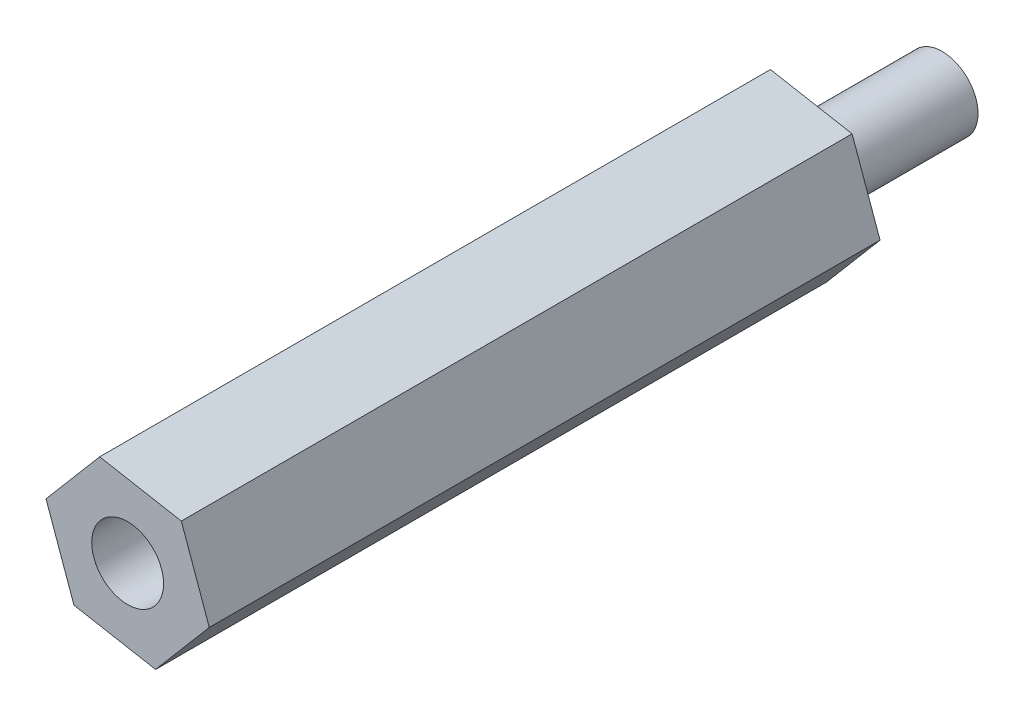
ISO-10303-21;
HEADER;
FILE_DESCRIPTION(('STEP AP214'),'2;1');
FILE_NAME('part.step','',(''),(''),'','','');
FILE_SCHEMA(('AUTOMOTIVE_DESIGN { 1 0 10303 214 1 1 1 1 }'));
ENDSEC;
DATA;
#1=APPLICATION_CONTEXT('core data for automotive mechanical design processes');
#2=APPLICATION_PROTOCOL_DEFINITION('international standard','automotive_design',2000,#1);
#3=PRODUCT_CONTEXT('',#1,'mechanical');
#4=PRODUCT('Part','Part','',(#3));
#5=PRODUCT_RELATED_PRODUCT_CATEGORY('part','',(#4));
#6=PRODUCT_DEFINITION_FORMATION('','',#4);
#7=PRODUCT_DEFINITION_CONTEXT('part definition',#1,'design');
#8=PRODUCT_DEFINITION('design','',#6,#7);
#9=PRODUCT_DEFINITION_SHAPE('','',#8);
#10=(LENGTH_UNIT() NAMED_UNIT(*) SI_UNIT(.MILLI.,.METRE.));
#11=(NAMED_UNIT(*) PLANE_ANGLE_UNIT() SI_UNIT($,.RADIAN.));
#12=(NAMED_UNIT(*) SI_UNIT($,.STERADIAN.) SOLID_ANGLE_UNIT());
#13=UNCERTAINTY_MEASURE_WITH_UNIT(LENGTH_MEASURE(1.E-05),#10,'distance_accuracy_value','');
#14=(GEOMETRIC_REPRESENTATION_CONTEXT(3) GLOBAL_UNCERTAINTY_ASSIGNED_CONTEXT((#13)) GLOBAL_UNIT_ASSIGNED_CONTEXT((#10,
#11,#12)) REPRESENTATION_CONTEXT('',''));
#15=CARTESIAN_POINT('',(0.,0.,0.));
#16=DIRECTION('',(0.,0.,1.));
#17=DIRECTION('',(1.,0.,0.));
#18=AXIS2_PLACEMENT_3D('',#15,#16,#17);
#19=CARTESIAN_POINT('',(10.6919799005155,-6.78529493686556,-6.));
#20=DIRECTION('',(0.,0.,1.));
#21=DIRECTION('',(1.,0.,0.));
#22=AXIS2_PLACEMENT_3D('',#19,#20,#21);
#23=CYLINDRICAL_SURFACE('',#22,1.5);
#24=CARTESIAN_POINT('',(10.6919799005155,-6.78529493686556,-6.));
#25=DIRECTION('',(0.,0.,-1.));
#26=DIRECTION('',(-1.,0.,0.));
#27=AXIS2_PLACEMENT_3D('',#24,#25,#26);
#28=CIRCLE('',#27,1.5);
#29=CARTESIAN_POINT('',(9.19197990051546,-6.78529493686556,-6.));
#30=VERTEX_POINT('',#29);
#31=EDGE_CURVE('E11',#30,#30,#28,.T.);
#32=ORIENTED_EDGE('',*,*,#31,.F.);
#33=EDGE_LOOP('',(#32));
#34=FACE_BOUND('',#33,.T.);
#35=CARTESIAN_POINT('',(10.6919799005155,-6.78529493686556,0.));
#36=DIRECTION('',(0.,0.,-1.));
#37=DIRECTION('',(-1.,0.,0.));
#38=AXIS2_PLACEMENT_3D('',#35,#36,#37);
#39=CIRCLE('',#38,1.5);
#40=CARTESIAN_POINT('',(9.19197990051546,-6.78529493686556,0.));
#41=VERTEX_POINT('',#40);
#42=EDGE_CURVE('E46',#41,#41,#39,.T.);
#43=ORIENTED_EDGE('',*,*,#42,.T.);
#44=EDGE_LOOP('',(#43));
#45=FACE_BOUND('',#44,.T.);
#46=ADVANCED_FACE('F43',(#34,#45),#23,.T.);
#47=CARTESIAN_POINT('',(10.6919799005155,-6.78529493686556,-6.));
#48=DIRECTION('',(0.,0.,-1.));
#49=DIRECTION('',(-1.,0.,0.));
#50=AXIS2_PLACEMENT_3D('',#47,#48,#49);
#51=PLANE('',#50);
#52=ORIENTED_EDGE('',*,*,#31,.T.);
#53=EDGE_LOOP('',(#52));
#54=FACE_BOUND('',#53,.T.);
#55=ADVANCED_FACE('F58',(#54),#51,.T.);
#56=CARTESIAN_POINT('',(10.6919799005155,-6.78529493686556,0.));
#57=DIRECTION('',(0.,0.,-1.));
#58=DIRECTION('',(-1.,0.,0.));
#59=AXIS2_PLACEMENT_3D('',#56,#57,#58);
#60=PLANE('',#59);
#61=ORIENTED_EDGE('',*,*,#42,.F.);
#62=EDGE_LOOP('',(#61));
#63=FACE_BOUND('',#62,.T.);
#64=ADVANCED_FACE('F56',(#63),#60,.F.);
#65=CLOSED_SHELL('',(#46,#55,#64));
#66=MANIFOLD_SOLID_BREP('B2',#65);
#67=CARTESIAN_POINT('',(14.100105118259,-7.40552271774973,28.));
#68=DIRECTION('',(-0.941553473498977,-0.336863557753005,0.));
#69=DIRECTION('',(0.336863557753005,-0.941553473498977,0.));
#70=AXIS2_PLACEMENT_3D('',#67,#68,#69);
#71=PLANE('',#70);
#72=DIRECTION('',(-0.336863557753005,0.941553473498977,0.));
#73=VECTOR('',#72,1.);
#74=CARTESIAN_POINT('',(14.100105118259,-7.40552271774973,0.));
#75=LINE('',#74,#73);
#76=CARTESIAN_POINT('',(14.100105118259,-7.40552271774973,0.));
#77=VERTEX_POINT('',#76);
#78=CARTESIAN_POINT('',(12.9331755237658,-4.14388580946336,0.));
#79=VERTEX_POINT('',#78);
#80=EDGE_CURVE('E168',#77,#79,#75,.T.);
#81=ORIENTED_EDGE('',*,*,#80,.T.);
#82=DIRECTION('',(0.,0.,-1.));
#83=VECTOR('',#82,1.);
#84=CARTESIAN_POINT('',(12.9331755237658,-4.14388580946336,28.));
#85=LINE('',#84,#83);
#86=CARTESIAN_POINT('',(12.9331755237658,-4.14388580946336,28.));
#87=VERTEX_POINT('',#86);
#88=EDGE_CURVE('E41',#87,#79,#85,.T.);
#89=ORIENTED_EDGE('',*,*,#88,.F.);
#90=DIRECTION('',(-0.336863557753005,0.941553473498977,0.));
#91=VECTOR('',#90,1.);
#92=CARTESIAN_POINT('',(14.100105118259,-7.40552271774973,28.));
#93=LINE('',#92,#91);
#94=CARTESIAN_POINT('',(14.100105118259,-7.40552271774973,28.));
#95=VERTEX_POINT('',#94);
#96=EDGE_CURVE('E179',#95,#87,#93,.T.);
#97=ORIENTED_EDGE('',*,*,#96,.F.);
#98=DIRECTION('',(0.,0.,-1.));
#99=VECTOR('',#98,1.);
#100=CARTESIAN_POINT('',(14.100105118259,-7.40552271774973,28.));
#101=LINE('',#100,#99);
#102=EDGE_CURVE('E164',#95,#77,#101,.T.);
#103=ORIENTED_EDGE('',*,*,#102,.T.);
#104=EDGE_LOOP('',(#81,#89,#97,#103));
#105=FACE_BOUND('',#104,.T.);
#106=ADVANCED_FACE('F84',(#105),#71,.F.);
#107=CARTESIAN_POINT('',(12.9331755237658,-4.14388580946336,28.));
#108=DIRECTION('',(-0.17904433812618,-0.983841005948094,0.));
#109=DIRECTION('',(0.983841005948094,-0.17904433812618,0.));
#110=AXIS2_PLACEMENT_3D('',#107,#108,#109);
#111=PLANE('',#110);
#112=DIRECTION('',(-0.983841005948094,0.17904433812618,0.));
#113=VECTOR('',#112,1.);
#114=CARTESIAN_POINT('',(12.9331755237658,-4.14388580946336,0.));
#115=LINE('',#114,#113);
#116=CARTESIAN_POINT('',(9.52505030602222,-3.52365802857919,0.));
#117=VERTEX_POINT('',#116);
#118=EDGE_CURVE('E171',#79,#117,#115,.T.);
#119=ORIENTED_EDGE('',*,*,#118,.T.);
#120=DIRECTION('',(0.,0.,-1.));
#121=VECTOR('',#120,1.);
#122=CARTESIAN_POINT('',(9.52505030602222,-3.52365802857919,28.));
#123=LINE('',#122,#121);
#124=CARTESIAN_POINT('',(9.52505030602222,-3.52365802857919,28.));
#125=VERTEX_POINT('',#124);
#126=EDGE_CURVE('E92',#125,#117,#123,.T.);
#127=ORIENTED_EDGE('',*,*,#126,.F.);
#128=DIRECTION('',(-0.983841005948094,0.17904433812618,0.));
#129=VECTOR('',#128,1.);
#130=CARTESIAN_POINT('',(12.9331755237658,-4.14388580946336,28.));
#131=LINE('',#130,#129);
#132=EDGE_CURVE('E137',#87,#125,#131,.T.);
#133=ORIENTED_EDGE('',*,*,#132,.F.);
#134=ORIENTED_EDGE('',*,*,#88,.T.);
#135=EDGE_LOOP('',(#119,#127,#133,#134));
#136=FACE_BOUND('',#135,.T.);
#137=ADVANCED_FACE('F204',(#136),#111,.F.);
#138=CARTESIAN_POINT('',(9.52505030602222,-3.52365802857919,28.));
#139=DIRECTION('',(0.762509135372797,-0.64697744819509,0.));
#140=DIRECTION('',(0.64697744819509,0.762509135372797,0.));
#141=AXIS2_PLACEMENT_3D('',#138,#139,#140);
#142=PLANE('',#141);
#143=DIRECTION('',(-0.64697744819509,-0.762509135372797,0.));
#144=VECTOR('',#143,1.);
#145=CARTESIAN_POINT('',(9.52505030602222,-3.52365802857919,0.));
#146=LINE('',#145,#144);
#147=CARTESIAN_POINT('',(7.28385468277191,-6.16506715598138,0.));
#148=VERTEX_POINT('',#147);
#149=EDGE_CURVE('E174',#117,#148,#146,.T.);
#150=ORIENTED_EDGE('',*,*,#149,.T.);
#151=DIRECTION('',(0.,0.,-1.));
#152=VECTOR('',#151,1.);
#153=CARTESIAN_POINT('',(7.28385468277191,-6.16506715598138,28.));
#154=LINE('',#153,#152);
#155=CARTESIAN_POINT('',(7.28385468277191,-6.16506715598138,28.));
#156=VERTEX_POINT('',#155);
#157=EDGE_CURVE('E159',#156,#148,#154,.T.);
#158=ORIENTED_EDGE('',*,*,#157,.F.);
#159=DIRECTION('',(-0.64697744819509,-0.762509135372797,0.));
#160=VECTOR('',#159,1.);
#161=CARTESIAN_POINT('',(9.52505030602222,-3.52365802857919,28.));
#162=LINE('',#161,#160);
#163=EDGE_CURVE('E150',#125,#156,#162,.T.);
#164=ORIENTED_EDGE('',*,*,#163,.F.);
#165=ORIENTED_EDGE('',*,*,#126,.T.);
#166=EDGE_LOOP('',(#150,#158,#164,#165));
#167=FACE_BOUND('',#166,.T.);
#168=ADVANCED_FACE('F185',(#167),#142,.F.);
#169=CARTESIAN_POINT('',(7.28385468277191,-6.16506715598138,28.));
#170=DIRECTION('',(0.941553473498977,0.336863557753005,0.));
#171=DIRECTION('',(-0.336863557753005,0.941553473498977,0.));
#172=AXIS2_PLACEMENT_3D('',#169,#170,#171);
#173=PLANE('',#172);
#174=DIRECTION('',(0.336863557753005,-0.941553473498977,0.));
#175=VECTOR('',#174,1.);
#176=CARTESIAN_POINT('',(7.28385468277191,-6.16506715598138,0.));
#177=LINE('',#176,#175);
#178=CARTESIAN_POINT('',(8.45078427726515,-9.42670406426776,0.));
#179=VERTEX_POINT('',#178);
#180=EDGE_CURVE('E158',#148,#179,#177,.T.);
#181=ORIENTED_EDGE('',*,*,#180,.T.);
#182=DIRECTION('',(0.,0.,-1.));
#183=VECTOR('',#182,1.);
#184=CARTESIAN_POINT('',(8.45078427726515,-9.42670406426776,28.));
#185=LINE('',#184,#183);
#186=CARTESIAN_POINT('',(8.45078427726515,-9.42670406426776,28.));
#187=VERTEX_POINT('',#186);
#188=EDGE_CURVE('E155',#187,#179,#185,.T.);
#189=ORIENTED_EDGE('',*,*,#188,.F.);
#190=DIRECTION('',(0.336863557753005,-0.941553473498977,0.));
#191=VECTOR('',#190,1.);
#192=CARTESIAN_POINT('',(7.28385468277191,-6.16506715598138,28.));
#193=LINE('',#192,#191);
#194=EDGE_CURVE('E144',#156,#187,#193,.T.);
#195=ORIENTED_EDGE('',*,*,#194,.F.);
#196=ORIENTED_EDGE('',*,*,#157,.T.);
#197=EDGE_LOOP('',(#181,#189,#195,#196));
#198=FACE_BOUND('',#197,.T.);
#199=ADVANCED_FACE('F156',(#198),#173,.F.);
#200=CARTESIAN_POINT('',(8.45078427726515,-9.42670406426776,28.));
#201=DIRECTION('',(0.17904433812618,0.983841005948094,0.));
#202=DIRECTION('',(-0.983841005948094,0.17904433812618,0.));
#203=AXIS2_PLACEMENT_3D('',#200,#201,#202);
#204=PLANE('',#203);
#205=DIRECTION('',(0.983841005948094,-0.17904433812618,0.));
#206=VECTOR('',#205,1.);
#207=CARTESIAN_POINT('',(8.45078427726515,-9.42670406426776,0.));
#208=LINE('',#207,#206);
#209=CARTESIAN_POINT('',(11.8589094950087,-10.0469318451519,0.));
#210=VERTEX_POINT('',#209);
#211=EDGE_CURVE('E123',#179,#210,#208,.T.);
#212=ORIENTED_EDGE('',*,*,#211,.T.);
#213=DIRECTION('',(0.,0.,-1.));
#214=VECTOR('',#213,1.);
#215=CARTESIAN_POINT('',(11.8589094950087,-10.0469318451519,28.));
#216=LINE('',#215,#214);
#217=CARTESIAN_POINT('',(11.8589094950087,-10.0469318451519,28.));
#218=VERTEX_POINT('',#217);
#219=EDGE_CURVE('E160',#218,#210,#216,.T.);
#220=ORIENTED_EDGE('',*,*,#219,.F.);
#221=DIRECTION('',(0.983841005948094,-0.17904433812618,0.));
#222=VECTOR('',#221,1.);
#223=CARTESIAN_POINT('',(8.45078427726515,-9.42670406426776,28.));
#224=LINE('',#223,#222);
#225=EDGE_CURVE('E148',#187,#218,#224,.T.);
#226=ORIENTED_EDGE('',*,*,#225,.F.);
#227=ORIENTED_EDGE('',*,*,#188,.T.);
#228=EDGE_LOOP('',(#212,#220,#226,#227));
#229=FACE_BOUND('',#228,.T.);
#230=ADVANCED_FACE('F162',(#229),#204,.F.);
#231=CARTESIAN_POINT('',(11.8589094950087,-10.0469318451519,28.));
#232=DIRECTION('',(-0.762509135372796,0.64697744819509,0.));
#233=DIRECTION('',(-0.64697744819509,-0.762509135372796,0.));
#234=AXIS2_PLACEMENT_3D('',#231,#232,#233);
#235=PLANE('',#234);
#236=DIRECTION('',(0.64697744819509,0.762509135372797,0.));
#237=VECTOR('',#236,1.);
#238=CARTESIAN_POINT('',(11.8589094950087,-10.0469318451519,0.));
#239=LINE('',#238,#237);
#240=EDGE_CURVE('E129',#210,#77,#239,.T.);
#241=ORIENTED_EDGE('',*,*,#240,.T.);
#242=ORIENTED_EDGE('',*,*,#102,.F.);
#243=DIRECTION('',(0.64697744819509,0.762509135372797,0.));
#244=VECTOR('',#243,1.);
#245=CARTESIAN_POINT('',(11.8589094950087,-10.0469318451519,28.));
#246=LINE('',#245,#244);
#247=EDGE_CURVE('E100',#218,#95,#246,.T.);
#248=ORIENTED_EDGE('',*,*,#247,.F.);
#249=ORIENTED_EDGE('',*,*,#219,.T.);
#250=EDGE_LOOP('',(#241,#242,#248,#249));
#251=FACE_BOUND('',#250,.T.);
#252=ADVANCED_FACE('F192',(#251),#235,.F.);
#253=CARTESIAN_POINT('',(0.,0.,28.));
#254=DIRECTION('',(0.,0.,1.));
#255=DIRECTION('',(1.,0.,0.));
#256=AXIS2_PLACEMENT_3D('',#253,#254,#255);
#257=PLANE('',#256);
#258=CARTESIAN_POINT('',(10.6919799005155,-6.78529493686556,28.));
#259=DIRECTION('',(0.,0.,1.));
#260=DIRECTION('',(1.,0.,0.));
#261=AXIS2_PLACEMENT_3D('',#258,#259,#260);
#262=CIRCLE('',#261,1.5);
#263=CARTESIAN_POINT('',(12.1919799005155,-6.78529493686556,28.));
#264=VERTEX_POINT('',#263);
#265=EDGE_CURVE('E172',#264,#264,#262,.T.);
#266=ORIENTED_EDGE('',*,*,#265,.F.);
#267=EDGE_LOOP('',(#266));
#268=FACE_BOUND('',#267,.T.);
#269=ORIENTED_EDGE('',*,*,#96,.T.);
#270=ORIENTED_EDGE('',*,*,#132,.T.);
#271=ORIENTED_EDGE('',*,*,#163,.T.);
#272=ORIENTED_EDGE('',*,*,#194,.T.);
#273=ORIENTED_EDGE('',*,*,#225,.T.);
#274=ORIENTED_EDGE('',*,*,#247,.T.);
#275=EDGE_LOOP('',(#269,#270,#271,#272,#273,#274));
#276=FACE_BOUND('',#275,.T.);
#277=ADVANCED_FACE('F146',(#268,#276),#257,.T.);
#278=CARTESIAN_POINT('',(0.,0.,0.));
#279=DIRECTION('',(0.,0.,1.));
#280=DIRECTION('',(1.,0.,0.));
#281=AXIS2_PLACEMENT_3D('',#278,#279,#280);
#282=PLANE('',#281);
#283=CARTESIAN_POINT('',(10.6919799005155,-6.78529493686556,0.));
#284=DIRECTION('',(0.,0.,-1.));
#285=DIRECTION('',(-1.,0.,0.));
#286=AXIS2_PLACEMENT_3D('',#283,#284,#285);
#287=CIRCLE('',#286,1.5);
#288=CARTESIAN_POINT('',(9.19197990051546,-6.78529493686556,0.));
#289=VERTEX_POINT('',#288);
#290=EDGE_CURVE('E259',#289,#289,#287,.T.);
#291=ORIENTED_EDGE('',*,*,#290,.F.);
#292=EDGE_LOOP('',(#291));
#293=FACE_BOUND('',#292,.T.);
#294=ORIENTED_EDGE('',*,*,#80,.F.);
#295=ORIENTED_EDGE('',*,*,#240,.F.);
#296=ORIENTED_EDGE('',*,*,#211,.F.);
#297=ORIENTED_EDGE('',*,*,#180,.F.);
#298=ORIENTED_EDGE('',*,*,#149,.F.);
#299=ORIENTED_EDGE('',*,*,#118,.F.);
#300=EDGE_LOOP('',(#294,#295,#296,#297,#298,#299));
#301=FACE_BOUND('',#300,.T.);
#302=ADVANCED_FACE('F188',(#293,#301),#282,.F.);
#303=CARTESIAN_POINT('',(10.6919799005155,-6.78529493686556,40.));
#304=DIRECTION('',(0.,0.,-1.));
#305=DIRECTION('',(-1.,0.,0.));
#306=AXIS2_PLACEMENT_3D('',#303,#304,#305);
#307=CYLINDRICAL_SURFACE('',#306,1.5);
#308=ORIENTED_EDGE('',*,*,#265,.T.);
#309=EDGE_LOOP('',(#308));
#310=FACE_BOUND('',#309,.T.);
#311=ORIENTED_EDGE('',*,*,#290,.T.);
#312=EDGE_LOOP('',(#311));
#313=FACE_BOUND('',#312,.T.);
#314=ADVANCED_FACE('F241',(#310,#313),#307,.F.);
#315=CLOSED_SHELL('',(#106,#137,#168,#199,#230,#252,#277,#302,#314));
#316=MANIFOLD_SOLID_BREP('B6',#315);
#317=ADVANCED_BREP_SHAPE_REPRESENTATION('',(#18,#66,#316),#14);
#318=SHAPE_DEFINITION_REPRESENTATION(#9,#317);
ENDSEC;
END-ISO-10303-21;
